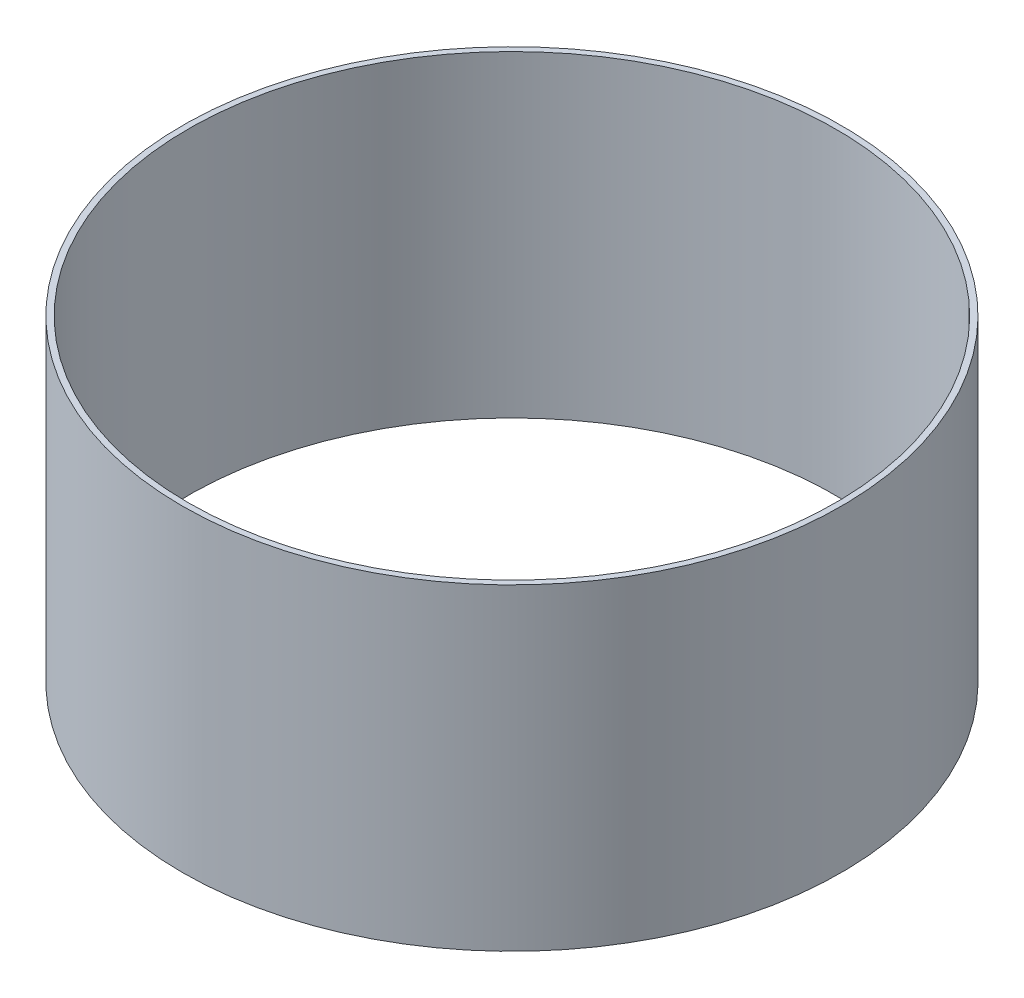
ISO-10303-21;
HEADER;
FILE_DESCRIPTION(('STEP AP214'),'2;1');
FILE_NAME('part.step','',(''),(''),'','','');
FILE_SCHEMA(('AUTOMOTIVE_DESIGN { 1 0 10303 214 1 1 1 1 }'));
ENDSEC;
DATA;
#1=APPLICATION_CONTEXT('core data for automotive mechanical design processes');
#2=APPLICATION_PROTOCOL_DEFINITION('international standard','automotive_design',2000,#1);
#3=PRODUCT_CONTEXT('',#1,'mechanical');
#4=PRODUCT('Part','Part','',(#3));
#5=PRODUCT_RELATED_PRODUCT_CATEGORY('part','',(#4));
#6=PRODUCT_DEFINITION_FORMATION('','',#4);
#7=PRODUCT_DEFINITION_CONTEXT('part definition',#1,'design');
#8=PRODUCT_DEFINITION('design','',#6,#7);
#9=PRODUCT_DEFINITION_SHAPE('','',#8);
#10=(LENGTH_UNIT() NAMED_UNIT(*) SI_UNIT(.MILLI.,.METRE.));
#11=(NAMED_UNIT(*) PLANE_ANGLE_UNIT() SI_UNIT($,.RADIAN.));
#12=(NAMED_UNIT(*) SI_UNIT($,.STERADIAN.) SOLID_ANGLE_UNIT());
#13=UNCERTAINTY_MEASURE_WITH_UNIT(LENGTH_MEASURE(1.E-05),#10,'distance_accuracy_value','');
#14=(GEOMETRIC_REPRESENTATION_CONTEXT(3) GLOBAL_UNCERTAINTY_ASSIGNED_CONTEXT((#13)) GLOBAL_UNIT_ASSIGNED_CONTEXT((#10,
#11,#12)) REPRESENTATION_CONTEXT('',''));
#15=CARTESIAN_POINT('',(0.,0.,0.));
#16=DIRECTION('',(0.,0.,1.));
#17=DIRECTION('',(1.,0.,0.));
#18=AXIS2_PLACEMENT_3D('',#15,#16,#17);
#19=CARTESIAN_POINT('',(0.,74.7,0.));
#20=DIRECTION('',(0.,1.,0.));
#21=DIRECTION('',(0.,0.,1.));
#22=AXIS2_PLACEMENT_3D('',#19,#20,#21);
#23=PLANE('',#22);
#24=CARTESIAN_POINT('',(0.,74.7,0.));
#25=DIRECTION('',(0.,1.,0.));
#26=DIRECTION('',(0.,0.,1.));
#27=AXIS2_PLACEMENT_3D('',#24,#25,#26);
#28=CIRCLE('',#27,77.58);
#29=CARTESIAN_POINT('',(0.,74.7,77.58));
#30=VERTEX_POINT('',#29);
#31=EDGE_CURVE('E12',#30,#30,#28,.T.);
#32=ORIENTED_EDGE('',*,*,#31,.T.);
#33=EDGE_LOOP('',(#32));
#34=FACE_BOUND('',#33,.T.);
#35=CARTESIAN_POINT('',(0.,74.7,0.));
#36=DIRECTION('',(0.,1.,0.));
#37=DIRECTION('',(0.,0.,1.));
#38=AXIS2_PLACEMENT_3D('',#35,#36,#37);
#39=CIRCLE('',#38,76.2);
#40=CARTESIAN_POINT('',(0.,74.7,76.2));
#41=VERTEX_POINT('',#40);
#42=EDGE_CURVE('E70',#41,#41,#39,.T.);
#43=ORIENTED_EDGE('',*,*,#42,.F.);
#44=EDGE_LOOP('',(#43));
#45=FACE_BOUND('',#44,.T.);
#46=ADVANCED_FACE('F55',(#34,#45),#23,.T.);
#47=CARTESIAN_POINT('',(0.,0.,0.));
#48=DIRECTION('',(0.,1.,0.));
#49=DIRECTION('',(0.,0.,1.));
#50=AXIS2_PLACEMENT_3D('',#47,#48,#49);
#51=PLANE('',#50);
#52=CARTESIAN_POINT('',(0.,0.,0.));
#53=DIRECTION('',(0.,1.,0.));
#54=DIRECTION('',(0.,0.,1.));
#55=AXIS2_PLACEMENT_3D('',#52,#53,#54);
#56=CIRCLE('',#55,77.58);
#57=CARTESIAN_POINT('',(0.,0.,77.58));
#58=VERTEX_POINT('',#57);
#59=EDGE_CURVE('E59',#58,#58,#56,.T.);
#60=ORIENTED_EDGE('',*,*,#59,.F.);
#61=EDGE_LOOP('',(#60));
#62=FACE_BOUND('',#61,.T.);
#63=CARTESIAN_POINT('',(0.,0.,0.));
#64=DIRECTION('',(0.,1.,0.));
#65=DIRECTION('',(0.,0.,1.));
#66=AXIS2_PLACEMENT_3D('',#63,#64,#65);
#67=CIRCLE('',#66,76.2);
#68=CARTESIAN_POINT('',(0.,0.,76.2));
#69=VERTEX_POINT('',#68);
#70=EDGE_CURVE('E72',#69,#69,#67,.T.);
#71=ORIENTED_EDGE('',*,*,#70,.T.);
#72=EDGE_LOOP('',(#71));
#73=FACE_BOUND('',#72,.T.);
#74=ADVANCED_FACE('F86',(#62,#73),#51,.F.);
#75=CARTESIAN_POINT('',(0.,74.7,0.));
#76=DIRECTION('',(0.,-1.,0.));
#77=DIRECTION('',(0.,0.,-1.));
#78=AXIS2_PLACEMENT_3D('',#75,#76,#77);
#79=CYLINDRICAL_SURFACE('',#78,77.58);
#80=ORIENTED_EDGE('',*,*,#31,.F.);
#81=EDGE_LOOP('',(#80));
#82=FACE_BOUND('',#81,.T.);
#83=ORIENTED_EDGE('',*,*,#59,.T.);
#84=EDGE_LOOP('',(#83));
#85=FACE_BOUND('',#84,.T.);
#86=ADVANCED_FACE('F57',(#82,#85),#79,.T.);
#87=CARTESIAN_POINT('',(0.,74.7,0.));
#88=DIRECTION('',(0.,-1.,0.));
#89=DIRECTION('',(0.,0.,-1.));
#90=AXIS2_PLACEMENT_3D('',#87,#88,#89);
#91=CYLINDRICAL_SURFACE('',#90,76.2);
#92=ORIENTED_EDGE('',*,*,#42,.T.);
#93=EDGE_LOOP('',(#92));
#94=FACE_BOUND('',#93,.T.);
#95=ORIENTED_EDGE('',*,*,#70,.F.);
#96=EDGE_LOOP('',(#95));
#97=FACE_BOUND('',#96,.T.);
#98=ADVANCED_FACE('F82',(#94,#97),#91,.F.);
#99=CLOSED_SHELL('',(#46,#74,#86,#98));
#100=MANIFOLD_SOLID_BREP('B2',#99);
#101=ADVANCED_BREP_SHAPE_REPRESENTATION('',(#18,#100),#14);
#102=SHAPE_DEFINITION_REPRESENTATION(#9,#101);
ENDSEC;
END-ISO-10303-21;
